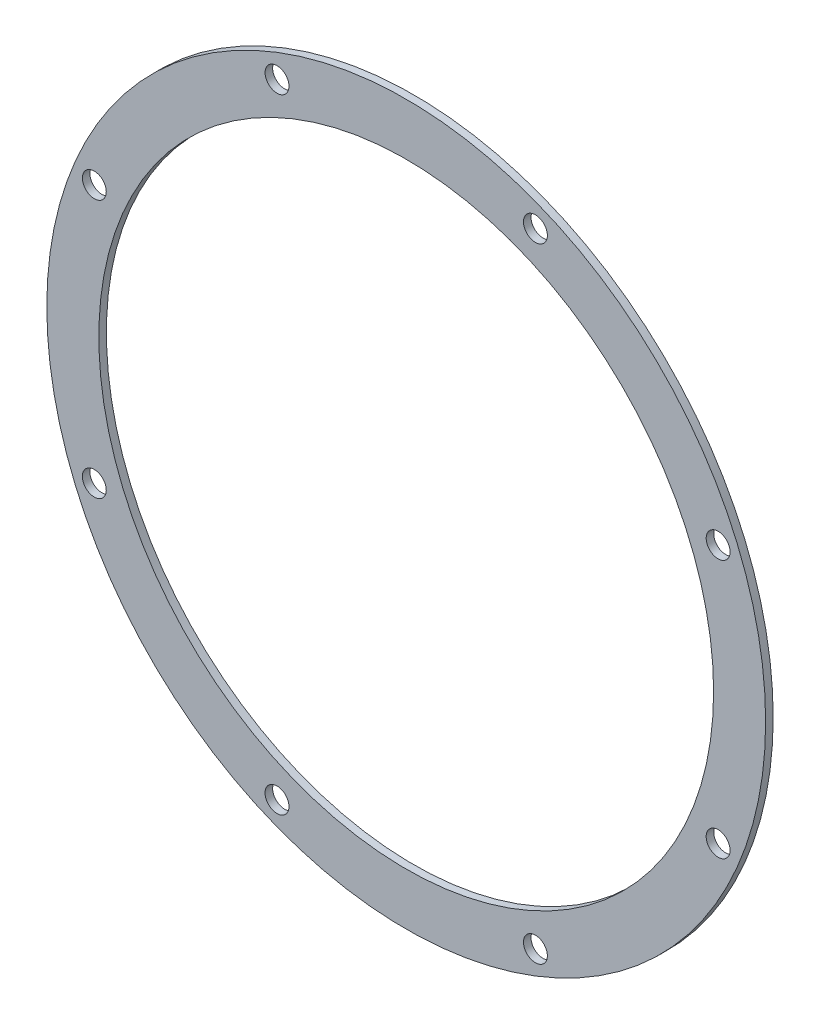
ISO-10303-21;
HEADER;
FILE_DESCRIPTION(('STEP AP214'),'2;1');
FILE_NAME('part.step','',(''),(''),'','','');
FILE_SCHEMA(('AUTOMOTIVE_DESIGN { 1 0 10303 214 1 1 1 1 }'));
ENDSEC;
DATA;
#1=APPLICATION_CONTEXT('core data for automotive mechanical design processes');
#2=APPLICATION_PROTOCOL_DEFINITION('international standard','automotive_design',2000,#1);
#3=PRODUCT_CONTEXT('',#1,'mechanical');
#4=PRODUCT('Part','Part','',(#3));
#5=PRODUCT_RELATED_PRODUCT_CATEGORY('part','',(#4));
#6=PRODUCT_DEFINITION_FORMATION('','',#4);
#7=PRODUCT_DEFINITION_CONTEXT('part definition',#1,'design');
#8=PRODUCT_DEFINITION('design','',#6,#7);
#9=PRODUCT_DEFINITION_SHAPE('','',#8);
#10=(LENGTH_UNIT() NAMED_UNIT(*) SI_UNIT(.MILLI.,.METRE.));
#11=(NAMED_UNIT(*) PLANE_ANGLE_UNIT() SI_UNIT($,.RADIAN.));
#12=(NAMED_UNIT(*) SI_UNIT($,.STERADIAN.) SOLID_ANGLE_UNIT());
#13=UNCERTAINTY_MEASURE_WITH_UNIT(LENGTH_MEASURE(1.E-05),#10,'distance_accuracy_value','');
#14=(GEOMETRIC_REPRESENTATION_CONTEXT(3) GLOBAL_UNCERTAINTY_ASSIGNED_CONTEXT((#13)) GLOBAL_UNIT_ASSIGNED_CONTEXT((#10,
#11,#12)) REPRESENTATION_CONTEXT('',''));
#15=CARTESIAN_POINT('',(0.,0.,0.));
#16=DIRECTION('',(0.,0.,1.));
#17=DIRECTION('',(1.,0.,0.));
#18=AXIS2_PLACEMENT_3D('',#15,#16,#17);
#19=CARTESIAN_POINT('',(0.,0.,1.6));
#20=DIRECTION('',(0.,0.,1.));
#21=DIRECTION('',(1.,0.,0.));
#22=AXIS2_PLACEMENT_3D('',#19,#20,#21);
#23=PLANE('',#22);
#24=CARTESIAN_POINT('',(-27.318507381217,65.9527110235235,1.6));
#25=DIRECTION('',(0.,0.,1.));
#26=DIRECTION('',(1.,0.,0.));
#27=AXIS2_PLACEMENT_3D('',#24,#25,#26);
#28=CIRCLE('',#27,2.52729999999999);
#29=CARTESIAN_POINT('',(-24.791207381217,65.9527110235235,1.6));
#30=VERTEX_POINT('',#29);
#31=EDGE_CURVE('E109',#30,#30,#28,.T.);
#32=ORIENTED_EDGE('',*,*,#31,.F.);
#33=EDGE_LOOP('',(#32));
#34=FACE_BOUND('',#33,.T.);
#35=CARTESIAN_POINT('',(27.3185073812169,65.9527110235235,1.6));
#36=DIRECTION('',(0.,0.,1.));
#37=DIRECTION('',(1.,0.,0.));
#38=AXIS2_PLACEMENT_3D('',#35,#36,#37);
#39=CIRCLE('',#38,2.52729999999999);
#40=CARTESIAN_POINT('',(29.8458073812169,65.9527110235235,1.6));
#41=VERTEX_POINT('',#40);
#42=EDGE_CURVE('E96',#41,#41,#39,.T.);
#43=ORIENTED_EDGE('',*,*,#42,.F.);
#44=EDGE_LOOP('',(#43));
#45=FACE_BOUND('',#44,.T.);
#46=CARTESIAN_POINT('',(65.9527110235235,27.318507381217,1.6));
#47=DIRECTION('',(0.,0.,1.));
#48=DIRECTION('',(1.,0.,0.));
#49=AXIS2_PLACEMENT_3D('',#46,#47,#48);
#50=CIRCLE('',#49,2.52729999999998);
#51=CARTESIAN_POINT('',(68.4800110235235,27.318507381217,1.6));
#52=VERTEX_POINT('',#51);
#53=EDGE_CURVE('E92',#52,#52,#50,.T.);
#54=ORIENTED_EDGE('',*,*,#53,.F.);
#55=EDGE_LOOP('',(#54));
#56=FACE_BOUND('',#55,.T.);
#57=CARTESIAN_POINT('',(65.9527110235235,-27.318507381217,1.6));
#58=DIRECTION('',(0.,0.,1.));
#59=DIRECTION('',(1.,0.,0.));
#60=AXIS2_PLACEMENT_3D('',#57,#58,#59);
#61=CIRCLE('',#60,2.5273);
#62=CARTESIAN_POINT('',(68.4800110235235,-27.318507381217,1.6));
#63=VERTEX_POINT('',#62);
#64=EDGE_CURVE('E88',#63,#63,#61,.T.);
#65=ORIENTED_EDGE('',*,*,#64,.F.);
#66=EDGE_LOOP('',(#65));
#67=FACE_BOUND('',#66,.T.);
#68=CARTESIAN_POINT('',(27.318507381217,-65.9527110235235,1.6));
#69=DIRECTION('',(0.,0.,1.));
#70=DIRECTION('',(1.,0.,0.));
#71=AXIS2_PLACEMENT_3D('',#68,#69,#70);
#72=CIRCLE('',#71,2.52729999999999);
#73=CARTESIAN_POINT('',(29.845807381217,-65.9527110235235,1.6));
#74=VERTEX_POINT('',#73);
#75=EDGE_CURVE('E83',#74,#74,#72,.T.);
#76=ORIENTED_EDGE('',*,*,#75,.F.);
#77=EDGE_LOOP('',(#76));
#78=FACE_BOUND('',#77,.T.);
#79=CARTESIAN_POINT('',(-27.3185073812169,-65.9527110235235,1.6));
#80=DIRECTION('',(0.,0.,1.));
#81=DIRECTION('',(1.,0.,0.));
#82=AXIS2_PLACEMENT_3D('',#79,#80,#81);
#83=CIRCLE('',#82,2.52729999999999);
#84=CARTESIAN_POINT('',(-24.7912073812169,-65.9527110235235,1.6));
#85=VERTEX_POINT('',#84);
#86=EDGE_CURVE('E78',#85,#85,#83,.T.);
#87=ORIENTED_EDGE('',*,*,#86,.F.);
#88=EDGE_LOOP('',(#87));
#89=FACE_BOUND('',#88,.T.);
#90=CARTESIAN_POINT('',(-65.9527110235235,-27.318507381217,1.6));
#91=DIRECTION('',(0.,0.,1.));
#92=DIRECTION('',(1.,0.,0.));
#93=AXIS2_PLACEMENT_3D('',#90,#91,#92);
#94=CIRCLE('',#93,2.52729999999998);
#95=CARTESIAN_POINT('',(-63.4254110235235,-27.318507381217,1.6));
#96=VERTEX_POINT('',#95);
#97=EDGE_CURVE('E73',#96,#96,#94,.T.);
#98=ORIENTED_EDGE('',*,*,#97,.F.);
#99=EDGE_LOOP('',(#98));
#100=FACE_BOUND('',#99,.T.);
#101=CARTESIAN_POINT('',(-65.9527110235235,27.318507381217,1.6));
#102=DIRECTION('',(0.,0.,1.));
#103=DIRECTION('',(1.,0.,0.));
#104=AXIS2_PLACEMENT_3D('',#101,#102,#103);
#105=CIRCLE('',#104,2.52729999999998);
#106=CARTESIAN_POINT('',(-63.4254110235235,27.318507381217,1.6));
#107=VERTEX_POINT('',#106);
#108=EDGE_CURVE('E68',#107,#107,#105,.T.);
#109=ORIENTED_EDGE('',*,*,#108,.F.);
#110=EDGE_LOOP('',(#109));
#111=FACE_BOUND('',#110,.T.);
#112=CARTESIAN_POINT('',(0.,0.,1.6));
#113=DIRECTION('',(0.,0.,1.));
#114=DIRECTION('',(1.,0.,0.));
#115=AXIS2_PLACEMENT_3D('',#112,#113,#114);
#116=CIRCLE('',#115,76.);
#117=CARTESIAN_POINT('',(76.,0.,1.6));
#118=VERTEX_POINT('',#117);
#119=EDGE_CURVE('E10',#118,#118,#116,.T.);
#120=ORIENTED_EDGE('',*,*,#119,.T.);
#121=EDGE_LOOP('',(#120));
#122=FACE_BOUND('',#121,.T.);
#123=CARTESIAN_POINT('',(0.,0.,1.6));
#124=DIRECTION('',(0.,0.,1.));
#125=DIRECTION('',(1.,0.,0.));
#126=AXIS2_PLACEMENT_3D('',#123,#124,#125);
#127=CIRCLE('',#126,65.);
#128=CARTESIAN_POINT('',(65.,0.,1.6));
#129=VERTEX_POINT('',#128);
#130=EDGE_CURVE('E58',#129,#129,#127,.T.);
#131=ORIENTED_EDGE('',*,*,#130,.F.);
#132=EDGE_LOOP('',(#131));
#133=FACE_BOUND('',#132,.T.);
#134=ADVANCED_FACE('F43',(#34,#45,#56,#67,#78,#89,#100,#111,#122,#133),#23,.T.);
#135=CARTESIAN_POINT('',(0.,0.,0.));
#136=DIRECTION('',(0.,0.,1.));
#137=DIRECTION('',(1.,0.,0.));
#138=AXIS2_PLACEMENT_3D('',#135,#136,#137);
#139=PLANE('',#138);
#140=CARTESIAN_POINT('',(-27.318507381217,65.9527110235235,0.));
#141=DIRECTION('',(0.,0.,1.));
#142=DIRECTION('',(1.,0.,0.));
#143=AXIS2_PLACEMENT_3D('',#140,#141,#142);
#144=CIRCLE('',#143,2.52729999999999);
#145=CARTESIAN_POINT('',(-24.791207381217,65.9527110235235,0.));
#146=VERTEX_POINT('',#145);
#147=EDGE_CURVE('E47',#146,#146,#144,.T.);
#148=ORIENTED_EDGE('',*,*,#147,.T.);
#149=EDGE_LOOP('',(#148));
#150=FACE_BOUND('',#149,.T.);
#151=CARTESIAN_POINT('',(27.3185073812169,65.9527110235235,0.));
#152=DIRECTION('',(0.,0.,1.));
#153=DIRECTION('',(1.,0.,0.));
#154=AXIS2_PLACEMENT_3D('',#151,#152,#153);
#155=CIRCLE('',#154,2.52729999999999);
#156=CARTESIAN_POINT('',(29.8458073812169,65.9527110235235,0.));
#157=VERTEX_POINT('',#156);
#158=EDGE_CURVE('E93',#157,#157,#155,.T.);
#159=ORIENTED_EDGE('',*,*,#158,.T.);
#160=EDGE_LOOP('',(#159));
#161=FACE_BOUND('',#160,.T.);
#162=CARTESIAN_POINT('',(65.9527110235235,27.318507381217,0.));
#163=DIRECTION('',(0.,0.,1.));
#164=DIRECTION('',(1.,0.,0.));
#165=AXIS2_PLACEMENT_3D('',#162,#163,#164);
#166=CIRCLE('',#165,2.52729999999999);
#167=CARTESIAN_POINT('',(68.4800110235235,27.318507381217,0.));
#168=VERTEX_POINT('',#167);
#169=EDGE_CURVE('E89',#168,#168,#166,.T.);
#170=ORIENTED_EDGE('',*,*,#169,.T.);
#171=EDGE_LOOP('',(#170));
#172=FACE_BOUND('',#171,.T.);
#173=CARTESIAN_POINT('',(65.9527110235235,-27.318507381217,0.));
#174=DIRECTION('',(0.,0.,1.));
#175=DIRECTION('',(1.,0.,0.));
#176=AXIS2_PLACEMENT_3D('',#173,#174,#175);
#177=CIRCLE('',#176,2.5273);
#178=CARTESIAN_POINT('',(68.4800110235235,-27.318507381217,0.));
#179=VERTEX_POINT('',#178);
#180=EDGE_CURVE('E84',#179,#179,#177,.T.);
#181=ORIENTED_EDGE('',*,*,#180,.T.);
#182=EDGE_LOOP('',(#181));
#183=FACE_BOUND('',#182,.T.);
#184=CARTESIAN_POINT('',(27.318507381217,-65.9527110235235,0.));
#185=DIRECTION('',(0.,0.,1.));
#186=DIRECTION('',(1.,0.,0.));
#187=AXIS2_PLACEMENT_3D('',#184,#185,#186);
#188=CIRCLE('',#187,2.52729999999999);
#189=CARTESIAN_POINT('',(29.845807381217,-65.9527110235235,0.));
#190=VERTEX_POINT('',#189);
#191=EDGE_CURVE('E79',#190,#190,#188,.T.);
#192=ORIENTED_EDGE('',*,*,#191,.T.);
#193=EDGE_LOOP('',(#192));
#194=FACE_BOUND('',#193,.T.);
#195=CARTESIAN_POINT('',(-27.3185073812169,-65.9527110235235,0.));
#196=DIRECTION('',(0.,0.,1.));
#197=DIRECTION('',(1.,0.,0.));
#198=AXIS2_PLACEMENT_3D('',#195,#196,#197);
#199=CIRCLE('',#198,2.52729999999999);
#200=CARTESIAN_POINT('',(-24.7912073812169,-65.9527110235235,0.));
#201=VERTEX_POINT('',#200);
#202=EDGE_CURVE('E74',#201,#201,#199,.T.);
#203=ORIENTED_EDGE('',*,*,#202,.T.);
#204=EDGE_LOOP('',(#203));
#205=FACE_BOUND('',#204,.T.);
#206=CARTESIAN_POINT('',(-65.9527110235235,-27.318507381217,0.));
#207=DIRECTION('',(0.,0.,1.));
#208=DIRECTION('',(1.,0.,0.));
#209=AXIS2_PLACEMENT_3D('',#206,#207,#208);
#210=CIRCLE('',#209,2.52729999999999);
#211=CARTESIAN_POINT('',(-63.4254110235235,-27.318507381217,0.));
#212=VERTEX_POINT('',#211);
#213=EDGE_CURVE('E69',#212,#212,#210,.T.);
#214=ORIENTED_EDGE('',*,*,#213,.T.);
#215=EDGE_LOOP('',(#214));
#216=FACE_BOUND('',#215,.T.);
#217=CARTESIAN_POINT('',(-65.9527110235235,27.318507381217,0.));
#218=DIRECTION('',(0.,0.,1.));
#219=DIRECTION('',(1.,0.,0.));
#220=AXIS2_PLACEMENT_3D('',#217,#218,#219);
#221=CIRCLE('',#220,2.52729999999999);
#222=CARTESIAN_POINT('',(-63.4254110235235,27.318507381217,0.));
#223=VERTEX_POINT('',#222);
#224=EDGE_CURVE('E64',#223,#223,#221,.T.);
#225=ORIENTED_EDGE('',*,*,#224,.T.);
#226=EDGE_LOOP('',(#225));
#227=FACE_BOUND('',#226,.T.);
#228=CARTESIAN_POINT('',(0.,0.,0.));
#229=DIRECTION('',(0.,0.,1.));
#230=DIRECTION('',(1.,0.,0.));
#231=AXIS2_PLACEMENT_3D('',#228,#229,#230);
#232=CIRCLE('',#231,76.);
#233=CARTESIAN_POINT('',(76.,0.,0.));
#234=VERTEX_POINT('',#233);
#235=EDGE_CURVE('E52',#234,#234,#232,.T.);
#236=ORIENTED_EDGE('',*,*,#235,.F.);
#237=EDGE_LOOP('',(#236));
#238=FACE_BOUND('',#237,.T.);
#239=CARTESIAN_POINT('',(0.,0.,0.));
#240=DIRECTION('',(0.,0.,1.));
#241=DIRECTION('',(1.,0.,0.));
#242=AXIS2_PLACEMENT_3D('',#239,#240,#241);
#243=CIRCLE('',#242,65.);
#244=CARTESIAN_POINT('',(65.,0.,0.));
#245=VERTEX_POINT('',#244);
#246=EDGE_CURVE('E61',#245,#245,#243,.T.);
#247=ORIENTED_EDGE('',*,*,#246,.T.);
#248=EDGE_LOOP('',(#247));
#249=FACE_BOUND('',#248,.T.);
#250=ADVANCED_FACE('F134',(#150,#161,#172,#183,#194,#205,#216,#227,#238,#249),#139,.F.);
#251=CARTESIAN_POINT('',(0.,0.,1.6));
#252=DIRECTION('',(0.,0.,-1.));
#253=DIRECTION('',(-1.,0.,0.));
#254=AXIS2_PLACEMENT_3D('',#251,#252,#253);
#255=CYLINDRICAL_SURFACE('',#254,76.);
#256=ORIENTED_EDGE('',*,*,#119,.F.);
#257=EDGE_LOOP('',(#256));
#258=FACE_BOUND('',#257,.T.);
#259=ORIENTED_EDGE('',*,*,#235,.T.);
#260=EDGE_LOOP('',(#259));
#261=FACE_BOUND('',#260,.T.);
#262=ADVANCED_FACE('F45',(#258,#261),#255,.T.);
#263=CARTESIAN_POINT('',(0.,0.,1.6));
#264=DIRECTION('',(0.,0.,-1.));
#265=DIRECTION('',(-1.,0.,0.));
#266=AXIS2_PLACEMENT_3D('',#263,#264,#265);
#267=CYLINDRICAL_SURFACE('',#266,65.);
#268=ORIENTED_EDGE('',*,*,#130,.T.);
#269=EDGE_LOOP('',(#268));
#270=FACE_BOUND('',#269,.T.);
#271=ORIENTED_EDGE('',*,*,#246,.F.);
#272=EDGE_LOOP('',(#271));
#273=FACE_BOUND('',#272,.T.);
#274=ADVANCED_FACE('F136',(#270,#273),#267,.F.);
#275=CARTESIAN_POINT('',(-65.9527110235235,27.318507381217,1.6));
#276=DIRECTION('',(0.,0.,1.));
#277=DIRECTION('',(1.,0.,0.));
#278=AXIS2_PLACEMENT_3D('',#275,#276,#277);
#279=CYLINDRICAL_SURFACE('',#278,2.52729999999999);
#280=ORIENTED_EDGE('',*,*,#108,.T.);
#281=EDGE_LOOP('',(#280));
#282=FACE_BOUND('',#281,.T.);
#283=ORIENTED_EDGE('',*,*,#224,.F.);
#284=EDGE_LOOP('',(#283));
#285=FACE_BOUND('',#284,.T.);
#286=ADVANCED_FACE('F138',(#282,#285),#279,.F.);
#287=CARTESIAN_POINT('',(-65.9527110235235,-27.318507381217,1.6));
#288=DIRECTION('',(0.,0.,1.));
#289=DIRECTION('',(1.,0.,0.));
#290=AXIS2_PLACEMENT_3D('',#287,#288,#289);
#291=CYLINDRICAL_SURFACE('',#290,2.52729999999999);
#292=ORIENTED_EDGE('',*,*,#97,.T.);
#293=EDGE_LOOP('',(#292));
#294=FACE_BOUND('',#293,.T.);
#295=ORIENTED_EDGE('',*,*,#213,.F.);
#296=EDGE_LOOP('',(#295));
#297=FACE_BOUND('',#296,.T.);
#298=ADVANCED_FACE('F145',(#294,#297),#291,.F.);
#299=CARTESIAN_POINT('',(-27.3185073812169,-65.9527110235235,1.6));
#300=DIRECTION('',(0.,0.,1.));
#301=DIRECTION('',(1.,0.,0.));
#302=AXIS2_PLACEMENT_3D('',#299,#300,#301);
#303=CYLINDRICAL_SURFACE('',#302,2.52729999999999);
#304=ORIENTED_EDGE('',*,*,#86,.T.);
#305=EDGE_LOOP('',(#304));
#306=FACE_BOUND('',#305,.T.);
#307=ORIENTED_EDGE('',*,*,#202,.F.);
#308=EDGE_LOOP('',(#307));
#309=FACE_BOUND('',#308,.T.);
#310=ADVANCED_FACE('F180',(#306,#309),#303,.F.);
#311=CARTESIAN_POINT('',(27.318507381217,-65.9527110235235,1.6));
#312=DIRECTION('',(0.,0.,1.));
#313=DIRECTION('',(1.,0.,0.));
#314=AXIS2_PLACEMENT_3D('',#311,#312,#313);
#315=CYLINDRICAL_SURFACE('',#314,2.52729999999999);
#316=ORIENTED_EDGE('',*,*,#75,.T.);
#317=EDGE_LOOP('',(#316));
#318=FACE_BOUND('',#317,.T.);
#319=ORIENTED_EDGE('',*,*,#191,.F.);
#320=EDGE_LOOP('',(#319));
#321=FACE_BOUND('',#320,.T.);
#322=ADVANCED_FACE('F187',(#318,#321),#315,.F.);
#323=CARTESIAN_POINT('',(65.9527110235235,-27.318507381217,1.6));
#324=DIRECTION('',(0.,0.,1.));
#325=DIRECTION('',(1.,0.,0.));
#326=AXIS2_PLACEMENT_3D('',#323,#324,#325);
#327=CYLINDRICAL_SURFACE('',#326,2.5273);
#328=ORIENTED_EDGE('',*,*,#64,.T.);
#329=EDGE_LOOP('',(#328));
#330=FACE_BOUND('',#329,.T.);
#331=ORIENTED_EDGE('',*,*,#180,.F.);
#332=EDGE_LOOP('',(#331));
#333=FACE_BOUND('',#332,.T.);
#334=ADVANCED_FACE('F193',(#330,#333),#327,.F.);
#335=CARTESIAN_POINT('',(65.9527110235235,27.318507381217,1.6));
#336=DIRECTION('',(0.,0.,1.));
#337=DIRECTION('',(1.,0.,0.));
#338=AXIS2_PLACEMENT_3D('',#335,#336,#337);
#339=CYLINDRICAL_SURFACE('',#338,2.52729999999999);
#340=ORIENTED_EDGE('',*,*,#53,.T.);
#341=EDGE_LOOP('',(#340));
#342=FACE_BOUND('',#341,.T.);
#343=ORIENTED_EDGE('',*,*,#169,.F.);
#344=EDGE_LOOP('',(#343));
#345=FACE_BOUND('',#344,.T.);
#346=ADVANCED_FACE('F197',(#342,#345),#339,.F.);
#347=CARTESIAN_POINT('',(27.3185073812169,65.9527110235235,1.6));
#348=DIRECTION('',(0.,0.,1.));
#349=DIRECTION('',(1.,0.,0.));
#350=AXIS2_PLACEMENT_3D('',#347,#348,#349);
#351=CYLINDRICAL_SURFACE('',#350,2.52729999999999);
#352=ORIENTED_EDGE('',*,*,#42,.T.);
#353=EDGE_LOOP('',(#352));
#354=FACE_BOUND('',#353,.T.);
#355=ORIENTED_EDGE('',*,*,#158,.F.);
#356=EDGE_LOOP('',(#355));
#357=FACE_BOUND('',#356,.T.);
#358=ADVANCED_FACE('F201',(#354,#357),#351,.F.);
#359=CARTESIAN_POINT('',(-27.318507381217,65.9527110235235,1.6));
#360=DIRECTION('',(0.,0.,1.));
#361=DIRECTION('',(1.,0.,0.));
#362=AXIS2_PLACEMENT_3D('',#359,#360,#361);
#363=CYLINDRICAL_SURFACE('',#362,2.52729999999999);
#364=ORIENTED_EDGE('',*,*,#31,.T.);
#365=EDGE_LOOP('',(#364));
#366=FACE_BOUND('',#365,.T.);
#367=ORIENTED_EDGE('',*,*,#147,.F.);
#368=EDGE_LOOP('',(#367));
#369=FACE_BOUND('',#368,.T.);
#370=ADVANCED_FACE('F205',(#366,#369),#363,.F.);
#371=CLOSED_SHELL('',(#134,#250,#262,#274,#286,#298,#310,#322,#334,#346,#358,#370));
#372=MANIFOLD_SOLID_BREP('B2',#371);
#373=ADVANCED_BREP_SHAPE_REPRESENTATION('',(#18,#372),#14);
#374=SHAPE_DEFINITION_REPRESENTATION(#9,#373);
ENDSEC;
END-ISO-10303-21;
